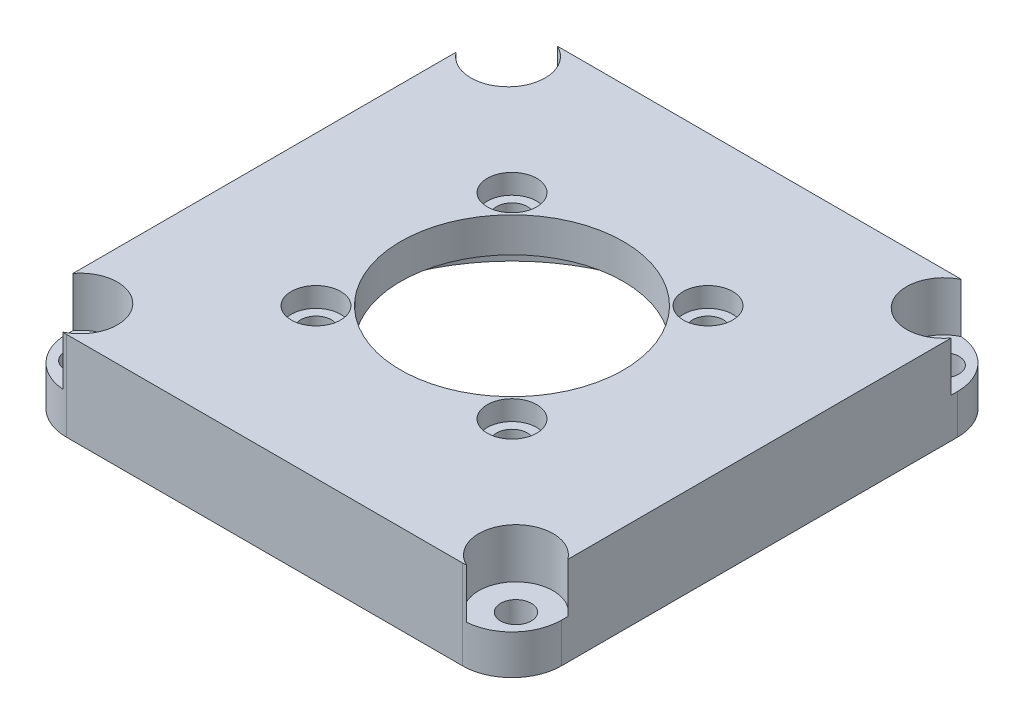
ISO-10303-21;
HEADER;
FILE_DESCRIPTION(('STEP AP214'),'2;1');
FILE_NAME('part.step','',(''),(''),'','','');
FILE_SCHEMA(('AUTOMOTIVE_DESIGN { 1 0 10303 214 1 1 1 1 }'));
ENDSEC;
DATA;
#1=APPLICATION_CONTEXT('core data for automotive mechanical design processes');
#2=APPLICATION_PROTOCOL_DEFINITION('international standard','automotive_design',2000,#1);
#3=PRODUCT_CONTEXT('',#1,'mechanical');
#4=PRODUCT('Part','Part','',(#3));
#5=PRODUCT_RELATED_PRODUCT_CATEGORY('part','',(#4));
#6=PRODUCT_DEFINITION_FORMATION('','',#4);
#7=PRODUCT_DEFINITION_CONTEXT('part definition',#1,'design');
#8=PRODUCT_DEFINITION('design','',#6,#7);
#9=PRODUCT_DEFINITION_SHAPE('','',#8);
#10=(LENGTH_UNIT() NAMED_UNIT(*) SI_UNIT(.MILLI.,.METRE.));
#11=(NAMED_UNIT(*) PLANE_ANGLE_UNIT() SI_UNIT($,.RADIAN.));
#12=(NAMED_UNIT(*) SI_UNIT($,.STERADIAN.) SOLID_ANGLE_UNIT());
#13=UNCERTAINTY_MEASURE_WITH_UNIT(LENGTH_MEASURE(1.E-05),#10,'distance_accuracy_value','');
#14=(GEOMETRIC_REPRESENTATION_CONTEXT(3) GLOBAL_UNCERTAINTY_ASSIGNED_CONTEXT((#13)) GLOBAL_UNIT_ASSIGNED_CONTEXT((#10,
#11,#12)) REPRESENTATION_CONTEXT('',''));
#15=CARTESIAN_POINT('',(0.,0.,0.));
#16=DIRECTION('',(0.,0.,1.));
#17=DIRECTION('',(1.,0.,0.));
#18=AXIS2_PLACEMENT_3D('',#15,#16,#17);
#19=CARTESIAN_POINT('',(-25.,12.,25.));
#20=DIRECTION('',(1.,0.,0.));
#21=DIRECTION('',(0.,0.,-1.));
#22=AXIS2_PLACEMENT_3D('',#19,#20,#21);
#23=PLANE('',#22);
#24=DIRECTION('',(0.,1.,0.));
#25=VECTOR('',#24,1.);
#26=CARTESIAN_POINT('',(-25.,4.,19.35));
#27=LINE('',#26,#25);
#28=CARTESIAN_POINT('',(-25.,9.,19.35));
#29=VERTEX_POINT('',#28);
#30=CARTESIAN_POINT('',(-25.,4.,19.35));
#31=VERTEX_POINT('',#30);
#32=EDGE_CURVE('E156',#29,#31,#27,.F.);
#33=ORIENTED_EDGE('',*,*,#32,.F.);
#34=DIRECTION('',(0.,0.,-1.));
#35=VECTOR('',#34,1.);
#36=CARTESIAN_POINT('',(-25.,9.,25.));
#37=LINE('',#36,#35);
#38=CARTESIAN_POINT('',(-25.,9.,-19.35));
#39=VERTEX_POINT('',#38);
#40=EDGE_CURVE('E166',#29,#39,#37,.T.);
#41=ORIENTED_EDGE('',*,*,#40,.T.);
#42=DIRECTION('',(0.,1.,0.));
#43=VECTOR('',#42,1.);
#44=CARTESIAN_POINT('',(-25.,4.,-19.35));
#45=LINE('',#44,#43);
#46=CARTESIAN_POINT('',(-25.,4.,-19.35));
#47=VERTEX_POINT('',#46);
#48=EDGE_CURVE('E308',#39,#47,#45,.F.);
#49=ORIENTED_EDGE('',*,*,#48,.T.);
#50=DIRECTION('',(0.,0.,1.));
#51=VECTOR('',#50,1.);
#52=CARTESIAN_POINT('',(-25.,4.,25.));
#53=LINE('',#52,#51);
#54=CARTESIAN_POINT('',(-25.,4.,-20.));
#55=VERTEX_POINT('',#54);
#56=EDGE_CURVE('E304',#55,#47,#53,.T.);
#57=ORIENTED_EDGE('',*,*,#56,.F.);
#58=DIRECTION('',(0.,-1.,0.));
#59=VECTOR('',#58,1.);
#60=CARTESIAN_POINT('',(-25.,12.,-20.));
#61=LINE('',#60,#59);
#62=CARTESIAN_POINT('',(-25.,0.,-20.));
#63=VERTEX_POINT('',#62);
#64=EDGE_CURVE('E209',#55,#63,#61,.T.);
#65=ORIENTED_EDGE('',*,*,#64,.T.);
#66=DIRECTION('',(0.,0.,1.));
#67=VECTOR('',#66,1.);
#68=CARTESIAN_POINT('',(-25.,0.,25.));
#69=LINE('',#68,#67);
#70=CARTESIAN_POINT('',(-25.,0.,20.));
#71=VERTEX_POINT('',#70);
#72=EDGE_CURVE('E201',#63,#71,#69,.T.);
#73=ORIENTED_EDGE('',*,*,#72,.T.);
#74=DIRECTION('',(0.,-1.,0.));
#75=VECTOR('',#74,1.);
#76=CARTESIAN_POINT('',(-25.,12.,20.));
#77=LINE('',#76,#75);
#78=CARTESIAN_POINT('',(-25.,4.,20.));
#79=VERTEX_POINT('',#78);
#80=EDGE_CURVE('E207',#71,#79,#77,.F.);
#81=ORIENTED_EDGE('',*,*,#80,.T.);
#82=DIRECTION('',(0.,0.,1.));
#83=VECTOR('',#82,1.);
#84=CARTESIAN_POINT('',(-25.,4.,25.));
#85=LINE('',#84,#83);
#86=EDGE_CURVE('E169',#31,#79,#85,.T.);
#87=ORIENTED_EDGE('',*,*,#86,.F.);
#88=EDGE_LOOP('',(#33,#41,#49,#57,#65,#73,#81,#87));
#89=FACE_BOUND('',#88,.T.);
#90=ADVANCED_FACE('F40',(#89),#23,.F.);
#91=CARTESIAN_POINT('',(-20.,12.,20.));
#92=DIRECTION('',(0.,-1.,0.));
#93=DIRECTION('',(0.,0.,-1.));
#94=AXIS2_PLACEMENT_3D('',#91,#92,#93);
#95=CYLINDRICAL_SURFACE('',#94,5.);
#96=CARTESIAN_POINT('',(-20.,9.,20.));
#97=DIRECTION('',(0.,-1.,0.));
#98=DIRECTION('',(0.,0.,-1.));
#99=AXIS2_PLACEMENT_3D('',#96,#97,#98);
#100=CIRCLE('',#99,5.);
#101=CARTESIAN_POINT('',(-20.3863331381223,9.,24.9850523273471));
#102=VERTEX_POINT('',#101);
#103=CARTESIAN_POINT('',(-20.,9.,25.));
#104=VERTEX_POINT('',#103);
#105=EDGE_CURVE('E177',#102,#104,#100,.F.);
#106=ORIENTED_EDGE('',*,*,#105,.F.);
#107=DIRECTION('',(0.,1.,0.));
#108=VECTOR('',#107,1.);
#109=CARTESIAN_POINT('',(-20.3863331381223,6.5,24.9850523273471));
#110=LINE('',#109,#108);
#111=CARTESIAN_POINT('',(-20.3863331381223,4.,24.9850523273471));
#112=VERTEX_POINT('',#111);
#113=EDGE_CURVE('E57',#102,#112,#110,.F.);
#114=ORIENTED_EDGE('',*,*,#113,.T.);
#115=CARTESIAN_POINT('',(-20.,4.,20.));
#116=DIRECTION('',(0.,1.,0.));
#117=DIRECTION('',(0.,0.,1.));
#118=AXIS2_PLACEMENT_3D('',#115,#116,#117);
#119=CIRCLE('',#118,5.);
#120=EDGE_CURVE('E705',#112,#79,#119,.F.);
#121=ORIENTED_EDGE('',*,*,#120,.T.);
#122=ORIENTED_EDGE('',*,*,#80,.F.);
#123=CARTESIAN_POINT('',(-20.,0.,20.));
#124=DIRECTION('',(0.,-1.,0.));
#125=DIRECTION('',(0.,0.,-1.));
#126=AXIS2_PLACEMENT_3D('',#123,#124,#125);
#127=CIRCLE('',#126,5.);
#128=CARTESIAN_POINT('',(-20.,0.,25.));
#129=VERTEX_POINT('',#128);
#130=EDGE_CURVE('E215',#129,#71,#127,.T.);
#131=ORIENTED_EDGE('',*,*,#130,.F.);
#132=DIRECTION('',(0.,-1.,0.));
#133=VECTOR('',#132,1.);
#134=CARTESIAN_POINT('',(-20.,12.,25.));
#135=LINE('',#134,#133);
#136=EDGE_CURVE('E227',#104,#129,#135,.T.);
#137=ORIENTED_EDGE('',*,*,#136,.F.);
#138=EDGE_LOOP('',(#106,#114,#121,#122,#131,#137));
#139=FACE_BOUND('',#138,.T.);
#140=ADVANCED_FACE('F393',(#139),#95,.T.);
#141=CARTESIAN_POINT('',(-22.,-3.,21.6));
#142=DIRECTION('',(0.,1.,0.));
#143=DIRECTION('',(0.,0.,1.));
#144=AXIS2_PLACEMENT_3D('',#141,#142,#143);
#145=CYLINDRICAL_SURFACE('',#144,1.55);
#146=CARTESIAN_POINT('',(-22.,0.,21.6));
#147=DIRECTION('',(0.,-1.,0.));
#148=DIRECTION('',(0.,0.,-1.));
#149=AXIS2_PLACEMENT_3D('',#146,#147,#148);
#150=CIRCLE('',#149,1.55);
#151=CARTESIAN_POINT('',(-22.,0.,20.05));
#152=VERTEX_POINT('',#151);
#153=EDGE_CURVE('E170',#152,#152,#150,.F.);
#154=ORIENTED_EDGE('',*,*,#153,.F.);
#155=EDGE_LOOP('',(#154));
#156=FACE_BOUND('',#155,.T.);
#157=CARTESIAN_POINT('',(-22.,4.,21.6));
#158=DIRECTION('',(0.,1.,0.));
#159=DIRECTION('',(0.,0.,1.));
#160=AXIS2_PLACEMENT_3D('',#157,#158,#159);
#161=CIRCLE('',#160,1.55);
#162=CARTESIAN_POINT('',(-22.,4.,23.15));
#163=VERTEX_POINT('',#162);
#164=EDGE_CURVE('E44',#163,#163,#161,.T.);
#165=ORIENTED_EDGE('',*,*,#164,.T.);
#166=EDGE_LOOP('',(#165));
#167=FACE_BOUND('',#166,.T.);
#168=ADVANCED_FACE('F398',(#156,#167),#145,.F.);
#169=CARTESIAN_POINT('',(22.,-3.,21.6));
#170=DIRECTION('',(0.,1.,0.));
#171=DIRECTION('',(0.,0.,1.));
#172=AXIS2_PLACEMENT_3D('',#169,#170,#171);
#173=CYLINDRICAL_SURFACE('',#172,1.55);
#174=CARTESIAN_POINT('',(22.,0.,21.6));
#175=DIRECTION('',(0.,-1.,0.));
#176=DIRECTION('',(0.,0.,-1.));
#177=AXIS2_PLACEMENT_3D('',#174,#175,#176);
#178=CIRCLE('',#177,1.55);
#179=CARTESIAN_POINT('',(22.,0.,20.05));
#180=VERTEX_POINT('',#179);
#181=EDGE_CURVE('E279',#180,#180,#178,.T.);
#182=ORIENTED_EDGE('',*,*,#181,.T.);
#183=EDGE_LOOP('',(#182));
#184=FACE_BOUND('',#183,.T.);
#185=CARTESIAN_POINT('',(22.,4.,21.6));
#186=DIRECTION('',(0.,1.,0.));
#187=DIRECTION('',(0.,0.,1.));
#188=AXIS2_PLACEMENT_3D('',#185,#186,#187);
#189=CIRCLE('',#188,1.55);
#190=CARTESIAN_POINT('',(22.,4.,23.15));
#191=VERTEX_POINT('',#190);
#192=EDGE_CURVE('E259',#191,#191,#189,.F.);
#193=ORIENTED_EDGE('',*,*,#192,.F.);
#194=EDGE_LOOP('',(#193));
#195=FACE_BOUND('',#194,.T.);
#196=ADVANCED_FACE('F411',(#184,#195),#173,.F.);
#197=CARTESIAN_POINT('',(25.,12.,25.));
#198=DIRECTION('',(-1.,0.,0.));
#199=DIRECTION('',(0.,0.,1.));
#200=AXIS2_PLACEMENT_3D('',#197,#198,#199);
#201=PLANE('',#200);
#202=DIRECTION('',(0.,0.,1.));
#203=VECTOR('',#202,1.);
#204=CARTESIAN_POINT('',(25.,9.,25.));
#205=LINE('',#204,#203);
#206=CARTESIAN_POINT('',(25.,9.,-19.35));
#207=VERTEX_POINT('',#206);
#208=CARTESIAN_POINT('',(25.,9.,19.35));
#209=VERTEX_POINT('',#208);
#210=EDGE_CURVE('E350',#207,#209,#205,.T.);
#211=ORIENTED_EDGE('',*,*,#210,.T.);
#212=DIRECTION('',(0.,1.,0.));
#213=VECTOR('',#212,1.);
#214=CARTESIAN_POINT('',(25.,4.,19.35));
#215=LINE('',#214,#213);
#216=CARTESIAN_POINT('',(25.,4.,19.35));
#217=VERTEX_POINT('',#216);
#218=EDGE_CURVE('E65',#209,#217,#215,.F.);
#219=ORIENTED_EDGE('',*,*,#218,.T.);
#220=DIRECTION('',(0.,0.,-1.));
#221=VECTOR('',#220,1.);
#222=CARTESIAN_POINT('',(25.,4.,25.));
#223=LINE('',#222,#221);
#224=CARTESIAN_POINT('',(25.,4.,20.));
#225=VERTEX_POINT('',#224);
#226=EDGE_CURVE('E266',#225,#217,#223,.T.);
#227=ORIENTED_EDGE('',*,*,#226,.F.);
#228=DIRECTION('',(0.,-1.,0.));
#229=VECTOR('',#228,1.);
#230=CARTESIAN_POINT('',(25.,12.,20.));
#231=LINE('',#230,#229);
#232=CARTESIAN_POINT('',(25.,0.,20.));
#233=VERTEX_POINT('',#232);
#234=EDGE_CURVE('E11',#225,#233,#231,.T.);
#235=ORIENTED_EDGE('',*,*,#234,.T.);
#236=DIRECTION('',(0.,0.,-1.));
#237=VECTOR('',#236,1.);
#238=CARTESIAN_POINT('',(25.,0.,25.));
#239=LINE('',#238,#237);
#240=CARTESIAN_POINT('',(25.,0.,-20.));
#241=VERTEX_POINT('',#240);
#242=EDGE_CURVE('E193',#233,#241,#239,.T.);
#243=ORIENTED_EDGE('',*,*,#242,.T.);
#244=DIRECTION('',(0.,-1.,0.));
#245=VECTOR('',#244,1.);
#246=CARTESIAN_POINT('',(25.,12.,-20.));
#247=LINE('',#246,#245);
#248=CARTESIAN_POINT('',(25.,4.,-20.));
#249=VERTEX_POINT('',#248);
#250=EDGE_CURVE('E49',#241,#249,#247,.F.);
#251=ORIENTED_EDGE('',*,*,#250,.T.);
#252=DIRECTION('',(0.,0.,-1.));
#253=VECTOR('',#252,1.);
#254=CARTESIAN_POINT('',(25.,4.,25.));
#255=LINE('',#254,#253);
#256=CARTESIAN_POINT('',(25.,4.,-19.35));
#257=VERTEX_POINT('',#256);
#258=EDGE_CURVE('E289',#257,#249,#255,.T.);
#259=ORIENTED_EDGE('',*,*,#258,.F.);
#260=DIRECTION('',(0.,1.,0.));
#261=VECTOR('',#260,1.);
#262=CARTESIAN_POINT('',(25.,4.,-19.35));
#263=LINE('',#262,#261);
#264=EDGE_CURVE('E294',#207,#257,#263,.F.);
#265=ORIENTED_EDGE('',*,*,#264,.F.);
#266=EDGE_LOOP('',(#211,#219,#227,#235,#243,#251,#259,#265));
#267=FACE_BOUND('',#266,.T.);
#268=ADVANCED_FACE('F408',(#267),#201,.F.);
#269=CARTESIAN_POINT('',(20.,12.,-20.));
#270=DIRECTION('',(0.,-1.,0.));
#271=DIRECTION('',(0.,0.,-1.));
#272=AXIS2_PLACEMENT_3D('',#269,#270,#271);
#273=CYLINDRICAL_SURFACE('',#272,5.);
#274=CARTESIAN_POINT('',(20.,9.,-20.));
#275=DIRECTION('',(0.,-1.,0.));
#276=DIRECTION('',(0.,0.,-1.));
#277=AXIS2_PLACEMENT_3D('',#274,#275,#276);
#278=CIRCLE('',#277,5.);
#279=CARTESIAN_POINT('',(20.3863331381223,9.,-24.9850523273471));
#280=VERTEX_POINT('',#279);
#281=CARTESIAN_POINT('',(20.,9.,-25.));
#282=VERTEX_POINT('',#281);
#283=EDGE_CURVE('E234',#280,#282,#278,.F.);
#284=ORIENTED_EDGE('',*,*,#283,.F.);
#285=DIRECTION('',(0.,1.,0.));
#286=VECTOR('',#285,1.);
#287=CARTESIAN_POINT('',(20.3863331381223,6.5,-24.9850523273471));
#288=LINE('',#287,#286);
#289=CARTESIAN_POINT('',(20.3863331381223,4.,-24.9850523273471));
#290=VERTEX_POINT('',#289);
#291=EDGE_CURVE('E291',#280,#290,#288,.F.);
#292=ORIENTED_EDGE('',*,*,#291,.T.);
#293=CARTESIAN_POINT('',(20.,4.,-20.));
#294=DIRECTION('',(0.,1.,0.));
#295=DIRECTION('',(0.,0.,1.));
#296=AXIS2_PLACEMENT_3D('',#293,#294,#295);
#297=CIRCLE('',#296,5.);
#298=EDGE_CURVE('E257',#290,#249,#297,.F.);
#299=ORIENTED_EDGE('',*,*,#298,.T.);
#300=ORIENTED_EDGE('',*,*,#250,.F.);
#301=CARTESIAN_POINT('',(20.,0.,-20.));
#302=DIRECTION('',(0.,-1.,0.));
#303=DIRECTION('',(0.,0.,-1.));
#304=AXIS2_PLACEMENT_3D('',#301,#302,#303);
#305=CIRCLE('',#304,5.);
#306=CARTESIAN_POINT('',(20.,0.,-25.));
#307=VERTEX_POINT('',#306);
#308=EDGE_CURVE('E211',#307,#241,#305,.T.);
#309=ORIENTED_EDGE('',*,*,#308,.F.);
#310=DIRECTION('',(0.,-1.,0.));
#311=VECTOR('',#310,1.);
#312=CARTESIAN_POINT('',(20.,12.,-25.));
#313=LINE('',#312,#311);
#314=EDGE_CURVE('E219',#282,#307,#313,.T.);
#315=ORIENTED_EDGE('',*,*,#314,.F.);
#316=EDGE_LOOP('',(#284,#292,#299,#300,#309,#315));
#317=FACE_BOUND('',#316,.T.);
#318=ADVANCED_FACE('F42',(#317),#273,.T.);
#319=CARTESIAN_POINT('',(22.,-3.,-21.6));
#320=DIRECTION('',(0.,1.,0.));
#321=DIRECTION('',(0.,0.,1.));
#322=AXIS2_PLACEMENT_3D('',#319,#320,#321);
#323=CYLINDRICAL_SURFACE('',#322,1.55);
#324=CARTESIAN_POINT('',(22.,0.,-21.6));
#325=DIRECTION('',(0.,-1.,0.));
#326=DIRECTION('',(0.,0.,-1.));
#327=AXIS2_PLACEMENT_3D('',#324,#325,#326);
#328=CIRCLE('',#327,1.55);
#329=CARTESIAN_POINT('',(22.,0.,-23.15));
#330=VERTEX_POINT('',#329);
#331=EDGE_CURVE('E296',#330,#330,#328,.F.);
#332=ORIENTED_EDGE('',*,*,#331,.F.);
#333=EDGE_LOOP('',(#332));
#334=FACE_BOUND('',#333,.T.);
#335=CARTESIAN_POINT('',(22.,4.,-21.6));
#336=DIRECTION('',(0.,1.,0.));
#337=DIRECTION('',(0.,0.,1.));
#338=AXIS2_PLACEMENT_3D('',#335,#336,#337);
#339=CIRCLE('',#338,1.55);
#340=CARTESIAN_POINT('',(22.,4.,-20.05));
#341=VERTEX_POINT('',#340);
#342=EDGE_CURVE('E255',#341,#341,#339,.T.);
#343=ORIENTED_EDGE('',*,*,#342,.T.);
#344=EDGE_LOOP('',(#343));
#345=FACE_BOUND('',#344,.T.);
#346=ADVANCED_FACE('F463',(#334,#345),#323,.F.);
#347=CARTESIAN_POINT('',(-22.,-3.,-21.6));
#348=DIRECTION('',(0.,1.,0.));
#349=DIRECTION('',(0.,0.,1.));
#350=AXIS2_PLACEMENT_3D('',#347,#348,#349);
#351=CYLINDRICAL_SURFACE('',#350,1.55);
#352=CARTESIAN_POINT('',(-22.,0.,-21.6));
#353=DIRECTION('',(0.,-1.,0.));
#354=DIRECTION('',(0.,0.,-1.));
#355=AXIS2_PLACEMENT_3D('',#352,#353,#354);
#356=CIRCLE('',#355,1.55);
#357=CARTESIAN_POINT('',(-22.,0.,-23.15));
#358=VERTEX_POINT('',#357);
#359=EDGE_CURVE('E310',#358,#358,#356,.T.);
#360=ORIENTED_EDGE('',*,*,#359,.T.);
#361=EDGE_LOOP('',(#360));
#362=FACE_BOUND('',#361,.T.);
#363=CARTESIAN_POINT('',(-22.,4.,-21.6));
#364=DIRECTION('',(0.,1.,0.));
#365=DIRECTION('',(0.,0.,1.));
#366=AXIS2_PLACEMENT_3D('',#363,#364,#365);
#367=CIRCLE('',#366,1.55);
#368=CARTESIAN_POINT('',(-22.,4.,-20.05));
#369=VERTEX_POINT('',#368);
#370=EDGE_CURVE('E250',#369,#369,#367,.F.);
#371=ORIENTED_EDGE('',*,*,#370,.F.);
#372=EDGE_LOOP('',(#371));
#373=FACE_BOUND('',#372,.T.);
#374=ADVANCED_FACE('F407',(#362,#373),#351,.F.);
#375=CARTESIAN_POINT('',(-25.,12.,-25.));
#376=DIRECTION('',(0.,0.,1.));
#377=DIRECTION('',(1.,0.,0.));
#378=AXIS2_PLACEMENT_3D('',#375,#376,#377);
#379=PLANE('',#378);
#380=DIRECTION('',(0.,-1.,0.));
#381=VECTOR('',#380,1.);
#382=CARTESIAN_POINT('',(-20.,12.,-25.));
#383=LINE('',#382,#381);
#384=CARTESIAN_POINT('',(-20.,0.,-25.));
#385=VERTEX_POINT('',#384);
#386=CARTESIAN_POINT('',(-20.,9.,-25.));
#387=VERTEX_POINT('',#386);
#388=EDGE_CURVE('E221',#385,#387,#383,.F.);
#389=ORIENTED_EDGE('',*,*,#388,.T.);
#390=DIRECTION('',(1.,0.,0.));
#391=VECTOR('',#390,1.);
#392=CARTESIAN_POINT('',(-25.,9.,-25.));
#393=LINE('',#392,#391);
#394=EDGE_CURVE('E347',#387,#282,#393,.T.);
#395=ORIENTED_EDGE('',*,*,#394,.T.);
#396=ORIENTED_EDGE('',*,*,#314,.T.);
#397=DIRECTION('',(-1.,0.,0.));
#398=VECTOR('',#397,1.);
#399=CARTESIAN_POINT('',(-25.,0.,-25.));
#400=LINE('',#399,#398);
#401=EDGE_CURVE('E198',#307,#385,#400,.T.);
#402=ORIENTED_EDGE('',*,*,#401,.T.);
#403=EDGE_LOOP('',(#389,#395,#396,#402));
#404=FACE_BOUND('',#403,.T.);
#405=ADVANCED_FACE('F362',(#404),#379,.F.);
#406=CARTESIAN_POINT('',(-25.,12.,25.));
#407=DIRECTION('',(0.,0.,-1.));
#408=DIRECTION('',(-1.,0.,0.));
#409=AXIS2_PLACEMENT_3D('',#406,#407,#408);
#410=PLANE('',#409);
#411=DIRECTION('',(0.,-1.,0.));
#412=VECTOR('',#411,1.);
#413=CARTESIAN_POINT('',(20.,12.,25.));
#414=LINE('',#413,#412);
#415=CARTESIAN_POINT('',(20.,0.,25.));
#416=VERTEX_POINT('',#415);
#417=CARTESIAN_POINT('',(20.,9.,25.));
#418=VERTEX_POINT('',#417);
#419=EDGE_CURVE('E224',#416,#418,#414,.F.);
#420=ORIENTED_EDGE('',*,*,#419,.T.);
#421=DIRECTION('',(-1.,0.,0.));
#422=VECTOR('',#421,1.);
#423=CARTESIAN_POINT('',(-25.,9.,25.));
#424=LINE('',#423,#422);
#425=EDGE_CURVE('E178',#418,#104,#424,.T.);
#426=ORIENTED_EDGE('',*,*,#425,.T.);
#427=ORIENTED_EDGE('',*,*,#136,.T.);
#428=DIRECTION('',(1.,0.,0.));
#429=VECTOR('',#428,1.);
#430=CARTESIAN_POINT('',(-25.,0.,25.));
#431=LINE('',#430,#429);
#432=EDGE_CURVE('E204',#129,#416,#431,.T.);
#433=ORIENTED_EDGE('',*,*,#432,.T.);
#434=EDGE_LOOP('',(#420,#426,#427,#433));
#435=FACE_BOUND('',#434,.T.);
#436=ADVANCED_FACE('F403',(#435),#410,.F.);
#437=CARTESIAN_POINT('',(0.,0.,0.));
#438=DIRECTION('',(0.,-1.,0.));
#439=DIRECTION('',(0.,0.,-1.));
#440=AXIS2_PLACEMENT_3D('',#437,#438,#439);
#441=PLANE('',#440);
#442=ORIENTED_EDGE('',*,*,#153,.T.);
#443=EDGE_LOOP('',(#442));
#444=FACE_BOUND('',#443,.T.);
#445=ORIENTED_EDGE('',*,*,#181,.F.);
#446=EDGE_LOOP('',(#445));
#447=FACE_BOUND('',#446,.T.);
#448=ORIENTED_EDGE('',*,*,#331,.T.);
#449=EDGE_LOOP('',(#448));
#450=FACE_BOUND('',#449,.T.);
#451=ORIENTED_EDGE('',*,*,#359,.F.);
#452=EDGE_LOOP('',(#451));
#453=FACE_BOUND('',#452,.T.);
#454=CARTESIAN_POINT('',(0.,0.,0.));
#455=DIRECTION('',(0.,-1.,0.));
#456=DIRECTION('',(0.,0.,-1.));
#457=AXIS2_PLACEMENT_3D('',#454,#455,#456);
#458=CIRCLE('',#457,18.25);
#459=CARTESIAN_POINT('',(0.,0.,-18.25));
#460=VERTEX_POINT('',#459);
#461=EDGE_CURVE('E189',#460,#460,#458,.T.);
#462=ORIENTED_EDGE('',*,*,#461,.F.);
#463=EDGE_LOOP('',(#462));
#464=FACE_BOUND('',#463,.T.);
#465=ORIENTED_EDGE('',*,*,#72,.F.);
#466=CARTESIAN_POINT('',(-20.,0.,-20.));
#467=DIRECTION('',(0.,-1.,0.));
#468=DIRECTION('',(0.,0.,-1.));
#469=AXIS2_PLACEMENT_3D('',#466,#467,#468);
#470=CIRCLE('',#469,5.);
#471=EDGE_CURVE('E217',#63,#385,#470,.T.);
#472=ORIENTED_EDGE('',*,*,#471,.T.);
#473=ORIENTED_EDGE('',*,*,#401,.F.);
#474=ORIENTED_EDGE('',*,*,#308,.T.);
#475=ORIENTED_EDGE('',*,*,#242,.F.);
#476=CARTESIAN_POINT('',(20.,0.,20.));
#477=DIRECTION('',(0.,-1.,0.));
#478=DIRECTION('',(0.,0.,-1.));
#479=AXIS2_PLACEMENT_3D('',#476,#477,#478);
#480=CIRCLE('',#479,5.);
#481=EDGE_CURVE('E213',#233,#416,#480,.T.);
#482=ORIENTED_EDGE('',*,*,#481,.T.);
#483=ORIENTED_EDGE('',*,*,#432,.F.);
#484=ORIENTED_EDGE('',*,*,#130,.T.);
#485=EDGE_LOOP('',(#465,#472,#473,#474,#475,#482,#483,#484));
#486=FACE_BOUND('',#485,.T.);
#487=ADVANCED_FACE('F368',(#444,#447,#450,#453,#464,#486),#441,.T.);
#488=CARTESIAN_POINT('',(-20.,12.,-20.));
#489=DIRECTION('',(0.,-1.,0.));
#490=DIRECTION('',(0.,0.,-1.));
#491=AXIS2_PLACEMENT_3D('',#488,#489,#490);
#492=CYLINDRICAL_SURFACE('',#491,5.);
#493=DIRECTION('',(0.,1.,0.));
#494=VECTOR('',#493,1.);
#495=CARTESIAN_POINT('',(-20.3863331381223,6.5,-24.9850523273471));
#496=LINE('',#495,#494);
#497=CARTESIAN_POINT('',(-20.3863331381223,9.,-24.9850523273471));
#498=VERTEX_POINT('',#497);
#499=CARTESIAN_POINT('',(-20.3863331381223,4.,-24.9850523273471));
#500=VERTEX_POINT('',#499);
#501=EDGE_CURVE('E306',#498,#500,#496,.F.);
#502=ORIENTED_EDGE('',*,*,#501,.F.);
#503=CARTESIAN_POINT('',(-20.,9.,-20.));
#504=DIRECTION('',(0.,-1.,0.));
#505=DIRECTION('',(0.,0.,-1.));
#506=AXIS2_PLACEMENT_3D('',#503,#504,#505);
#507=CIRCLE('',#506,5.);
#508=EDGE_CURVE('E183',#387,#498,#507,.F.);
#509=ORIENTED_EDGE('',*,*,#508,.F.);
#510=ORIENTED_EDGE('',*,*,#388,.F.);
#511=ORIENTED_EDGE('',*,*,#471,.F.);
#512=ORIENTED_EDGE('',*,*,#64,.F.);
#513=CARTESIAN_POINT('',(-20.,4.,-20.));
#514=DIRECTION('',(0.,1.,0.));
#515=DIRECTION('',(0.,0.,1.));
#516=AXIS2_PLACEMENT_3D('',#513,#514,#515);
#517=CIRCLE('',#516,5.);
#518=EDGE_CURVE('E253',#55,#500,#517,.F.);
#519=ORIENTED_EDGE('',*,*,#518,.T.);
#520=EDGE_LOOP('',(#502,#509,#510,#511,#512,#519));
#521=FACE_BOUND('',#520,.T.);
#522=ADVANCED_FACE('F359',(#521),#492,.T.);
#523=CARTESIAN_POINT('',(20.,12.,20.));
#524=DIRECTION('',(0.,-1.,0.));
#525=DIRECTION('',(0.,0.,-1.));
#526=AXIS2_PLACEMENT_3D('',#523,#524,#525);
#527=CYLINDRICAL_SURFACE('',#526,5.);
#528=DIRECTION('',(0.,1.,0.));
#529=VECTOR('',#528,1.);
#530=CARTESIAN_POINT('',(20.3863331381223,6.5,24.9850523273471));
#531=LINE('',#530,#529);
#532=CARTESIAN_POINT('',(20.3863331381223,9.,24.9850523273471));
#533=VERTEX_POINT('',#532);
#534=CARTESIAN_POINT('',(20.3863331381223,4.,24.9850523273471));
#535=VERTEX_POINT('',#534);
#536=EDGE_CURVE('E276',#533,#535,#531,.F.);
#537=ORIENTED_EDGE('',*,*,#536,.F.);
#538=CARTESIAN_POINT('',(20.,9.,20.));
#539=DIRECTION('',(0.,-1.,0.));
#540=DIRECTION('',(0.,0.,-1.));
#541=AXIS2_PLACEMENT_3D('',#538,#539,#540);
#542=CIRCLE('',#541,5.);
#543=EDGE_CURVE('E353',#418,#533,#542,.F.);
#544=ORIENTED_EDGE('',*,*,#543,.F.);
#545=ORIENTED_EDGE('',*,*,#419,.F.);
#546=ORIENTED_EDGE('',*,*,#481,.F.);
#547=ORIENTED_EDGE('',*,*,#234,.F.);
#548=CARTESIAN_POINT('',(20.,4.,20.));
#549=DIRECTION('',(0.,1.,0.));
#550=DIRECTION('',(0.,0.,1.));
#551=AXIS2_PLACEMENT_3D('',#548,#549,#550);
#552=CIRCLE('',#551,5.);
#553=EDGE_CURVE('E261',#225,#535,#552,.F.);
#554=ORIENTED_EDGE('',*,*,#553,.T.);
#555=EDGE_LOOP('',(#537,#544,#545,#546,#547,#554));
#556=FACE_BOUND('',#555,.T.);
#557=ADVANCED_FACE('F414',(#556),#527,.T.);
#558=CARTESIAN_POINT('',(0.,5.5,0.));
#559=DIRECTION('',(0.,-1.,0.));
#560=DIRECTION('',(0.,0.,-1.));
#561=AXIS2_PLACEMENT_3D('',#558,#559,#560);
#562=CYLINDRICAL_SURFACE('',#561,18.25);
#563=CARTESIAN_POINT('',(0.,5.5,0.));
#564=DIRECTION('',(0.,-1.,0.));
#565=DIRECTION('',(0.,0.,-1.));
#566=AXIS2_PLACEMENT_3D('',#563,#564,#565);
#567=CIRCLE('',#566,18.25);
#568=CARTESIAN_POINT('',(0.,5.5,-18.25));
#569=VERTEX_POINT('',#568);
#570=EDGE_CURVE('E190',#569,#569,#567,.T.);
#571=ORIENTED_EDGE('',*,*,#570,.F.);
#572=EDGE_LOOP('',(#571));
#573=FACE_BOUND('',#572,.T.);
#574=ORIENTED_EDGE('',*,*,#461,.T.);
#575=EDGE_LOOP('',(#574));
#576=FACE_BOUND('',#575,.T.);
#577=ADVANCED_FACE('F416',(#573,#576),#562,.F.);
#578=CARTESIAN_POINT('',(0.,5.5,0.));
#579=DIRECTION('',(0.,-1.,0.));
#580=DIRECTION('',(0.,0.,-1.));
#581=AXIS2_PLACEMENT_3D('',#578,#579,#580);
#582=PLANE('',#581);
#583=CARTESIAN_POINT('',(9.89949493661167,5.5,-9.89949493661166));
#584=DIRECTION('',(0.,-1.,0.));
#585=DIRECTION('',(0.,0.,-1.));
#586=AXIS2_PLACEMENT_3D('',#583,#584,#585);
#587=CIRCLE('',#586,1.55);
#588=CARTESIAN_POINT('',(9.89949493661167,5.5,-11.4494949366117));
#589=VERTEX_POINT('',#588);
#590=EDGE_CURVE('E246',#589,#589,#587,.T.);
#591=ORIENTED_EDGE('',*,*,#590,.F.);
#592=EDGE_LOOP('',(#591));
#593=FACE_BOUND('',#592,.T.);
#594=CARTESIAN_POINT('',(-9.89949493661166,5.5,9.89949493661167));
#595=DIRECTION('',(0.,-1.,0.));
#596=DIRECTION('',(0.,0.,-1.));
#597=AXIS2_PLACEMENT_3D('',#594,#595,#596);
#598=CIRCLE('',#597,1.55);
#599=CARTESIAN_POINT('',(-9.89949493661166,5.5,8.34949493661167));
#600=VERTEX_POINT('',#599);
#601=EDGE_CURVE('E243',#600,#600,#598,.T.);
#602=ORIENTED_EDGE('',*,*,#601,.F.);
#603=EDGE_LOOP('',(#602));
#604=FACE_BOUND('',#603,.T.);
#605=CARTESIAN_POINT('',(9.89949493661167,5.5,9.89949493661167));
#606=DIRECTION('',(0.,-1.,0.));
#607=DIRECTION('',(0.,0.,-1.));
#608=AXIS2_PLACEMENT_3D('',#605,#606,#607);
#609=CIRCLE('',#608,1.55);
#610=CARTESIAN_POINT('',(9.89949493661167,5.5,8.34949493661167));
#611=VERTEX_POINT('',#610);
#612=EDGE_CURVE('E239',#611,#611,#609,.T.);
#613=ORIENTED_EDGE('',*,*,#612,.F.);
#614=EDGE_LOOP('',(#613));
#615=FACE_BOUND('',#614,.T.);
#616=CARTESIAN_POINT('',(-9.89949493661165,5.5,-9.89949493661168));
#617=DIRECTION('',(0.,-1.,0.));
#618=DIRECTION('',(0.,0.,-1.));
#619=AXIS2_PLACEMENT_3D('',#616,#617,#618);
#620=CIRCLE('',#619,1.55);
#621=CARTESIAN_POINT('',(-9.89949493661165,5.5,-11.4494949366117));
#622=VERTEX_POINT('',#621);
#623=EDGE_CURVE('E236',#622,#622,#620,.T.);
#624=ORIENTED_EDGE('',*,*,#623,.F.);
#625=EDGE_LOOP('',(#624));
#626=FACE_BOUND('',#625,.T.);
#627=CARTESIAN_POINT('',(0.,5.5,0.));
#628=DIRECTION('',(0.,-1.,0.));
#629=DIRECTION('',(0.,0.,-1.));
#630=AXIS2_PLACEMENT_3D('',#627,#628,#629);
#631=CIRCLE('',#630,11.25);
#632=CARTESIAN_POINT('',(0.,5.5,-11.25));
#633=VERTEX_POINT('',#632);
#634=EDGE_CURVE('E180',#633,#633,#631,.T.);
#635=ORIENTED_EDGE('',*,*,#634,.F.);
#636=EDGE_LOOP('',(#635));
#637=FACE_BOUND('',#636,.T.);
#638=ORIENTED_EDGE('',*,*,#570,.T.);
#639=EDGE_LOOP('',(#638));
#640=FACE_BOUND('',#639,.T.);
#641=ADVANCED_FACE('F421',(#593,#604,#615,#626,#637,#640),#582,.T.);
#642=CARTESIAN_POINT('',(0.,15.5,0.));
#643=DIRECTION('',(0.,-1.,0.));
#644=DIRECTION('',(0.,0.,-1.));
#645=AXIS2_PLACEMENT_3D('',#642,#643,#644);
#646=CYLINDRICAL_SURFACE('',#645,11.25);
#647=CARTESIAN_POINT('',(0.,9.,0.));
#648=DIRECTION('',(0.,-1.,0.));
#649=DIRECTION('',(0.,0.,-1.));
#650=AXIS2_PLACEMENT_3D('',#647,#648,#649);
#651=CIRCLE('',#650,11.25);
#652=CARTESIAN_POINT('',(0.,9.,-11.25));
#653=VERTEX_POINT('',#652);
#654=EDGE_CURVE('E231',#653,#653,#651,.F.);
#655=ORIENTED_EDGE('',*,*,#654,.T.);
#656=EDGE_LOOP('',(#655));
#657=FACE_BOUND('',#656,.T.);
#658=ORIENTED_EDGE('',*,*,#634,.T.);
#659=EDGE_LOOP('',(#658));
#660=FACE_BOUND('',#659,.T.);
#661=ADVANCED_FACE('F492',(#657,#660),#646,.F.);
#662=CARTESIAN_POINT('',(0.,9.,0.));
#663=DIRECTION('',(0.,-1.,0.));
#664=DIRECTION('',(0.,0.,-1.));
#665=AXIS2_PLACEMENT_3D('',#662,#663,#664);
#666=PLANE('',#665);
#667=CARTESIAN_POINT('',(-22.,9.,21.6));
#668=DIRECTION('',(0.,-1.,0.));
#669=DIRECTION('',(0.,0.,-1.));
#670=AXIS2_PLACEMENT_3D('',#667,#668,#669);
#671=CIRCLE('',#670,3.75);
#672=EDGE_CURVE('E153',#29,#102,#671,.T.);
#673=ORIENTED_EDGE('',*,*,#672,.T.);
#674=ORIENTED_EDGE('',*,*,#105,.T.);
#675=ORIENTED_EDGE('',*,*,#425,.F.);
#676=ORIENTED_EDGE('',*,*,#543,.T.);
#677=CARTESIAN_POINT('',(22.,9.,21.6));
#678=DIRECTION('',(0.,1.,0.));
#679=DIRECTION('',(0.,0.,-1.));
#680=AXIS2_PLACEMENT_3D('',#677,#678,#679);
#681=CIRCLE('',#680,3.75);
#682=EDGE_CURVE('E269',#209,#533,#681,.T.);
#683=ORIENTED_EDGE('',*,*,#682,.F.);
#684=ORIENTED_EDGE('',*,*,#210,.F.);
#685=CARTESIAN_POINT('',(22.,9.,-21.6));
#686=DIRECTION('',(0.,-1.,0.));
#687=DIRECTION('',(0.,0.,1.));
#688=AXIS2_PLACEMENT_3D('',#685,#686,#687);
#689=CIRCLE('',#688,3.75);
#690=EDGE_CURVE('E282',#207,#280,#689,.T.);
#691=ORIENTED_EDGE('',*,*,#690,.T.);
#692=ORIENTED_EDGE('',*,*,#283,.T.);
#693=ORIENTED_EDGE('',*,*,#394,.F.);
#694=ORIENTED_EDGE('',*,*,#508,.T.);
#695=CARTESIAN_POINT('',(-22.,9.,-21.6));
#696=DIRECTION('',(0.,1.,0.));
#697=DIRECTION('',(0.,0.,1.));
#698=AXIS2_PLACEMENT_3D('',#695,#696,#697);
#699=CIRCLE('',#698,3.75);
#700=EDGE_CURVE('E176',#39,#498,#699,.T.);
#701=ORIENTED_EDGE('',*,*,#700,.F.);
#702=ORIENTED_EDGE('',*,*,#40,.F.);
#703=EDGE_LOOP('',(#673,#674,#675,#676,#683,#684,#691,#692,#693,#694,#701,#702));
#704=FACE_BOUND('',#703,.T.);
#705=CARTESIAN_POINT('',(9.89949493661167,9.,-9.89949493661166));
#706=DIRECTION('',(0.,1.,0.));
#707=DIRECTION('',(0.,0.,1.));
#708=AXIS2_PLACEMENT_3D('',#705,#706,#707);
#709=CIRCLE('',#708,2.5);
#710=CARTESIAN_POINT('',(9.89949493661167,9.,-7.39949493661166));
#711=VERTEX_POINT('',#710);
#712=EDGE_CURVE('E334',#711,#711,#709,.T.);
#713=ORIENTED_EDGE('',*,*,#712,.F.);
#714=EDGE_LOOP('',(#713));
#715=FACE_BOUND('',#714,.T.);
#716=CARTESIAN_POINT('',(-9.89949493661166,9.,9.89949493661167));
#717=DIRECTION('',(0.,1.,0.));
#718=DIRECTION('',(0.,0.,1.));
#719=AXIS2_PLACEMENT_3D('',#716,#717,#718);
#720=CIRCLE('',#719,2.5);
#721=CARTESIAN_POINT('',(-9.89949493661166,9.,12.3994949366117));
#722=VERTEX_POINT('',#721);
#723=EDGE_CURVE('E327',#722,#722,#720,.T.);
#724=ORIENTED_EDGE('',*,*,#723,.F.);
#725=EDGE_LOOP('',(#724));
#726=FACE_BOUND('',#725,.T.);
#727=CARTESIAN_POINT('',(9.89949493661167,9.,9.89949493661167));
#728=DIRECTION('',(0.,1.,0.));
#729=DIRECTION('',(0.,0.,1.));
#730=AXIS2_PLACEMENT_3D('',#727,#728,#729);
#731=CIRCLE('',#730,2.5);
#732=CARTESIAN_POINT('',(9.89949493661167,9.,12.3994949366117));
#733=VERTEX_POINT('',#732);
#734=EDGE_CURVE('E249',#733,#733,#731,.T.);
#735=ORIENTED_EDGE('',*,*,#734,.F.);
#736=EDGE_LOOP('',(#735));
#737=FACE_BOUND('',#736,.T.);
#738=CARTESIAN_POINT('',(-9.89949493661165,9.,-9.89949493661168));
#739=DIRECTION('',(0.,1.,0.));
#740=DIRECTION('',(0.,0.,1.));
#741=AXIS2_PLACEMENT_3D('',#738,#739,#740);
#742=CIRCLE('',#741,2.5);
#743=CARTESIAN_POINT('',(-9.89949493661165,9.,-7.39949493661168));
#744=VERTEX_POINT('',#743);
#745=EDGE_CURVE('E333',#744,#744,#742,.T.);
#746=ORIENTED_EDGE('',*,*,#745,.F.);
#747=EDGE_LOOP('',(#746));
#748=FACE_BOUND('',#747,.T.);
#749=ORIENTED_EDGE('',*,*,#654,.F.);
#750=EDGE_LOOP('',(#749));
#751=FACE_BOUND('',#750,.T.);
#752=ADVANCED_FACE('F173',(#704,#715,#726,#737,#748,#751),#666,.F.);
#753=CARTESIAN_POINT('',(-9.89949493661165,7.,-9.89949493661168));
#754=DIRECTION('',(0.,1.,0.));
#755=DIRECTION('',(0.,0.,1.));
#756=AXIS2_PLACEMENT_3D('',#753,#754,#755);
#757=CYLINDRICAL_SURFACE('',#756,2.5);
#758=CARTESIAN_POINT('',(-9.89949493661165,7.,-9.89949493661168));
#759=DIRECTION('',(0.,1.,0.));
#760=DIRECTION('',(0.,0.,1.));
#761=AXIS2_PLACEMENT_3D('',#758,#759,#760);
#762=CIRCLE('',#761,2.5);
#763=CARTESIAN_POINT('',(-9.89949493661165,7.,-7.39949493661168));
#764=VERTEX_POINT('',#763);
#765=EDGE_CURVE('E235',#764,#764,#762,.T.);
#766=ORIENTED_EDGE('',*,*,#765,.F.);
#767=EDGE_LOOP('',(#766));
#768=FACE_BOUND('',#767,.T.);
#769=ORIENTED_EDGE('',*,*,#745,.T.);
#770=EDGE_LOOP('',(#769));
#771=FACE_BOUND('',#770,.T.);
#772=ADVANCED_FACE('F499',(#768,#771),#757,.F.);
#773=CARTESIAN_POINT('',(-9.89949493661165,7.,-9.89949493661168));
#774=DIRECTION('',(0.,1.,0.));
#775=DIRECTION('',(0.,0.,1.));
#776=AXIS2_PLACEMENT_3D('',#773,#774,#775);
#777=PLANE('',#776);
#778=CARTESIAN_POINT('',(-9.89949493661165,7.,-9.89949493661168));
#779=DIRECTION('',(0.,1.,0.));
#780=DIRECTION('',(0.,0.,1.));
#781=AXIS2_PLACEMENT_3D('',#778,#779,#780);
#782=CIRCLE('',#781,1.55);
#783=CARTESIAN_POINT('',(-9.89949493661165,7.,-8.34949493661168));
#784=VERTEX_POINT('',#783);
#785=EDGE_CURVE('E240',#784,#784,#782,.T.);
#786=ORIENTED_EDGE('',*,*,#785,.F.);
#787=EDGE_LOOP('',(#786));
#788=FACE_BOUND('',#787,.T.);
#789=ORIENTED_EDGE('',*,*,#765,.T.);
#790=EDGE_LOOP('',(#789));
#791=FACE_BOUND('',#790,.T.);
#792=ADVANCED_FACE('F502',(#788,#791),#777,.T.);
#793=CARTESIAN_POINT('',(9.89949493661167,7.,9.89949493661167));
#794=DIRECTION('',(0.,1.,0.));
#795=DIRECTION('',(0.,0.,1.));
#796=AXIS2_PLACEMENT_3D('',#793,#794,#795);
#797=CYLINDRICAL_SURFACE('',#796,2.5);
#798=CARTESIAN_POINT('',(9.89949493661167,7.,9.89949493661167));
#799=DIRECTION('',(0.,1.,0.));
#800=DIRECTION('',(0.,0.,1.));
#801=AXIS2_PLACEMENT_3D('',#798,#799,#800);
#802=CIRCLE('',#801,2.5);
#803=CARTESIAN_POINT('',(9.89949493661167,7.,12.3994949366117));
#804=VERTEX_POINT('',#803);
#805=EDGE_CURVE('E324',#804,#804,#802,.T.);
#806=ORIENTED_EDGE('',*,*,#805,.F.);
#807=EDGE_LOOP('',(#806));
#808=FACE_BOUND('',#807,.T.);
#809=ORIENTED_EDGE('',*,*,#734,.T.);
#810=EDGE_LOOP('',(#809));
#811=FACE_BOUND('',#810,.T.);
#812=ADVANCED_FACE('F506',(#808,#811),#797,.F.);
#813=CARTESIAN_POINT('',(9.89949493661167,7.,9.89949493661167));
#814=DIRECTION('',(0.,1.,0.));
#815=DIRECTION('',(0.,0.,1.));
#816=AXIS2_PLACEMENT_3D('',#813,#814,#815);
#817=PLANE('',#816);
#818=CARTESIAN_POINT('',(9.89949493661167,7.,9.89949493661167));
#819=DIRECTION('',(0.,1.,0.));
#820=DIRECTION('',(0.,0.,1.));
#821=AXIS2_PLACEMENT_3D('',#818,#819,#820);
#822=CIRCLE('',#821,1.55);
#823=CARTESIAN_POINT('',(9.89949493661167,7.,11.4494949366117));
#824=VERTEX_POINT('',#823);
#825=EDGE_CURVE('E313',#824,#824,#822,.T.);
#826=ORIENTED_EDGE('',*,*,#825,.F.);
#827=EDGE_LOOP('',(#826));
#828=FACE_BOUND('',#827,.T.);
#829=ORIENTED_EDGE('',*,*,#805,.T.);
#830=EDGE_LOOP('',(#829));
#831=FACE_BOUND('',#830,.T.);
#832=ADVANCED_FACE('F512',(#828,#831),#817,.T.);
#833=CARTESIAN_POINT('',(-9.89949493661166,7.,9.89949493661167));
#834=DIRECTION('',(0.,1.,0.));
#835=DIRECTION('',(0.,0.,1.));
#836=AXIS2_PLACEMENT_3D('',#833,#834,#835);
#837=CYLINDRICAL_SURFACE('',#836,2.5);
#838=CARTESIAN_POINT('',(-9.89949493661166,7.,9.89949493661167));
#839=DIRECTION('',(0.,1.,0.));
#840=DIRECTION('',(0.,0.,1.));
#841=AXIS2_PLACEMENT_3D('',#838,#839,#840);
#842=CIRCLE('',#841,2.5);
#843=CARTESIAN_POINT('',(-9.89949493661166,7.,12.3994949366117));
#844=VERTEX_POINT('',#843);
#845=EDGE_CURVE('E337',#844,#844,#842,.T.);
#846=ORIENTED_EDGE('',*,*,#845,.F.);
#847=EDGE_LOOP('',(#846));
#848=FACE_BOUND('',#847,.T.);
#849=ORIENTED_EDGE('',*,*,#723,.T.);
#850=EDGE_LOOP('',(#849));
#851=FACE_BOUND('',#850,.T.);
#852=ADVANCED_FACE('F508',(#848,#851),#837,.F.);
#853=CARTESIAN_POINT('',(-9.89949493661166,7.,9.89949493661167));
#854=DIRECTION('',(0.,1.,0.));
#855=DIRECTION('',(0.,0.,1.));
#856=AXIS2_PLACEMENT_3D('',#853,#854,#855);
#857=PLANE('',#856);
#858=CARTESIAN_POINT('',(-9.89949493661166,7.,9.89949493661167));
#859=DIRECTION('',(0.,1.,0.));
#860=DIRECTION('',(0.,0.,1.));
#861=AXIS2_PLACEMENT_3D('',#858,#859,#860);
#862=CIRCLE('',#861,1.55);
#863=CARTESIAN_POINT('',(-9.89949493661166,7.,11.4494949366117));
#864=VERTEX_POINT('',#863);
#865=EDGE_CURVE('E316',#864,#864,#862,.T.);
#866=ORIENTED_EDGE('',*,*,#865,.F.);
#867=EDGE_LOOP('',(#866));
#868=FACE_BOUND('',#867,.T.);
#869=ORIENTED_EDGE('',*,*,#845,.T.);
#870=EDGE_LOOP('',(#869));
#871=FACE_BOUND('',#870,.T.);
#872=ADVANCED_FACE('F511',(#868,#871),#857,.T.);
#873=CARTESIAN_POINT('',(9.89949493661167,7.,-9.89949493661166));
#874=DIRECTION('',(0.,1.,0.));
#875=DIRECTION('',(0.,0.,1.));
#876=AXIS2_PLACEMENT_3D('',#873,#874,#875);
#877=CYLINDRICAL_SURFACE('',#876,2.5);
#878=CARTESIAN_POINT('',(9.89949493661167,7.,-9.89949493661166));
#879=DIRECTION('',(0.,1.,0.));
#880=DIRECTION('',(0.,0.,1.));
#881=AXIS2_PLACEMENT_3D('',#878,#879,#880);
#882=CIRCLE('',#881,2.5);
#883=CARTESIAN_POINT('',(9.89949493661167,7.,-7.39949493661166));
#884=VERTEX_POINT('',#883);
#885=EDGE_CURVE('E330',#884,#884,#882,.T.);
#886=ORIENTED_EDGE('',*,*,#885,.F.);
#887=EDGE_LOOP('',(#886));
#888=FACE_BOUND('',#887,.T.);
#889=ORIENTED_EDGE('',*,*,#712,.T.);
#890=EDGE_LOOP('',(#889));
#891=FACE_BOUND('',#890,.T.);
#892=ADVANCED_FACE('F516',(#888,#891),#877,.F.);
#893=CARTESIAN_POINT('',(9.89949493661167,7.,-9.89949493661166));
#894=DIRECTION('',(0.,1.,0.));
#895=DIRECTION('',(0.,0.,1.));
#896=AXIS2_PLACEMENT_3D('',#893,#894,#895);
#897=PLANE('',#896);
#898=CARTESIAN_POINT('',(9.89949493661167,7.,-9.89949493661166));
#899=DIRECTION('',(0.,1.,0.));
#900=DIRECTION('',(0.,0.,1.));
#901=AXIS2_PLACEMENT_3D('',#898,#899,#900);
#902=CIRCLE('',#901,1.55);
#903=CARTESIAN_POINT('',(9.89949493661167,7.,-8.34949493661166));
#904=VERTEX_POINT('',#903);
#905=EDGE_CURVE('E317',#904,#904,#902,.T.);
#906=ORIENTED_EDGE('',*,*,#905,.F.);
#907=EDGE_LOOP('',(#906));
#908=FACE_BOUND('',#907,.T.);
#909=ORIENTED_EDGE('',*,*,#885,.T.);
#910=EDGE_LOOP('',(#909));
#911=FACE_BOUND('',#910,.T.);
#912=ADVANCED_FACE('F520',(#908,#911),#897,.T.);
#913=CARTESIAN_POINT('',(-9.89949493661165,4.,-9.89949493661168));
#914=DIRECTION('',(0.,1.,0.));
#915=DIRECTION('',(0.,0.,1.));
#916=AXIS2_PLACEMENT_3D('',#913,#914,#915);
#917=CYLINDRICAL_SURFACE('',#916,1.55);
#918=ORIENTED_EDGE('',*,*,#623,.T.);
#919=EDGE_LOOP('',(#918));
#920=FACE_BOUND('',#919,.T.);
#921=ORIENTED_EDGE('',*,*,#785,.T.);
#922=EDGE_LOOP('',(#921));
#923=FACE_BOUND('',#922,.T.);
#924=ADVANCED_FACE('F524',(#920,#923),#917,.F.);
#925=CARTESIAN_POINT('',(9.89949493661167,4.,9.89949493661167));
#926=DIRECTION('',(0.,1.,0.));
#927=DIRECTION('',(0.,0.,1.));
#928=AXIS2_PLACEMENT_3D('',#925,#926,#927);
#929=CYLINDRICAL_SURFACE('',#928,1.55);
#930=ORIENTED_EDGE('',*,*,#612,.T.);
#931=EDGE_LOOP('',(#930));
#932=FACE_BOUND('',#931,.T.);
#933=ORIENTED_EDGE('',*,*,#825,.T.);
#934=EDGE_LOOP('',(#933));
#935=FACE_BOUND('',#934,.T.);
#936=ADVANCED_FACE('F534',(#932,#935),#929,.F.);
#937=CARTESIAN_POINT('',(-9.89949493661166,4.,9.89949493661167));
#938=DIRECTION('',(0.,1.,0.));
#939=DIRECTION('',(0.,0.,1.));
#940=AXIS2_PLACEMENT_3D('',#937,#938,#939);
#941=CYLINDRICAL_SURFACE('',#940,1.55);
#942=ORIENTED_EDGE('',*,*,#601,.T.);
#943=EDGE_LOOP('',(#942));
#944=FACE_BOUND('',#943,.T.);
#945=ORIENTED_EDGE('',*,*,#865,.T.);
#946=EDGE_LOOP('',(#945));
#947=FACE_BOUND('',#946,.T.);
#948=ADVANCED_FACE('F388',(#944,#947),#941,.F.);
#949=CARTESIAN_POINT('',(9.89949493661167,4.,-9.89949493661166));
#950=DIRECTION('',(0.,1.,0.));
#951=DIRECTION('',(0.,0.,1.));
#952=AXIS2_PLACEMENT_3D('',#949,#950,#951);
#953=CYLINDRICAL_SURFACE('',#952,1.55);
#954=ORIENTED_EDGE('',*,*,#590,.T.);
#955=EDGE_LOOP('',(#954));
#956=FACE_BOUND('',#955,.T.);
#957=ORIENTED_EDGE('',*,*,#905,.T.);
#958=EDGE_LOOP('',(#957));
#959=FACE_BOUND('',#958,.T.);
#960=ADVANCED_FACE('F379',(#956,#959),#953,.F.);
#961=CARTESIAN_POINT('',(-22.,4.,-21.6));
#962=DIRECTION('',(0.,1.,0.));
#963=DIRECTION('',(0.,0.,1.));
#964=AXIS2_PLACEMENT_3D('',#961,#962,#963);
#965=CYLINDRICAL_SURFACE('',#964,3.75);
#966=ORIENTED_EDGE('',*,*,#700,.T.);
#967=ORIENTED_EDGE('',*,*,#501,.T.);
#968=CARTESIAN_POINT('',(-22.,4.,-21.6));
#969=DIRECTION('',(0.,1.,0.));
#970=DIRECTION('',(0.,0.,1.));
#971=AXIS2_PLACEMENT_3D('',#968,#969,#970);
#972=CIRCLE('',#971,3.75);
#973=EDGE_CURVE('E254',#47,#500,#972,.T.);
#974=ORIENTED_EDGE('',*,*,#973,.F.);
#975=ORIENTED_EDGE('',*,*,#48,.F.);
#976=EDGE_LOOP('',(#966,#967,#974,#975));
#977=FACE_BOUND('',#976,.T.);
#978=ADVANCED_FACE('F377',(#977),#965,.F.);
#979=CARTESIAN_POINT('',(-22.,4.,-21.6));
#980=DIRECTION('',(0.,1.,0.));
#981=DIRECTION('',(0.,0.,1.));
#982=AXIS2_PLACEMENT_3D('',#979,#980,#981);
#983=PLANE('',#982);
#984=ORIENTED_EDGE('',*,*,#370,.T.);
#985=EDGE_LOOP('',(#984));
#986=FACE_BOUND('',#985,.T.);
#987=ORIENTED_EDGE('',*,*,#56,.T.);
#988=ORIENTED_EDGE('',*,*,#973,.T.);
#989=ORIENTED_EDGE('',*,*,#518,.F.);
#990=EDGE_LOOP('',(#987,#988,#989));
#991=FACE_BOUND('',#990,.T.);
#992=ADVANCED_FACE('F375',(#986,#991),#983,.T.);
#993=CARTESIAN_POINT('',(22.,4.,-21.6));
#994=DIRECTION('',(0.,1.,0.));
#995=DIRECTION('',(0.,0.,1.));
#996=AXIS2_PLACEMENT_3D('',#993,#994,#995);
#997=CYLINDRICAL_SURFACE('',#996,3.75);
#998=ORIENTED_EDGE('',*,*,#264,.T.);
#999=CARTESIAN_POINT('',(22.,4.,-21.6));
#1000=DIRECTION('',(0.,-1.,0.));
#1001=DIRECTION('',(0.,0.,1.));
#1002=AXIS2_PLACEMENT_3D('',#999,#1000,#1001);
#1003=CIRCLE('',#1002,3.75);
#1004=EDGE_CURVE('E258',#257,#290,#1003,.T.);
#1005=ORIENTED_EDGE('',*,*,#1004,.T.);
#1006=ORIENTED_EDGE('',*,*,#291,.F.);
#1007=ORIENTED_EDGE('',*,*,#690,.F.);
#1008=EDGE_LOOP('',(#998,#1005,#1006,#1007));
#1009=FACE_BOUND('',#1008,.T.);
#1010=ADVANCED_FACE('F385',(#1009),#997,.F.);
#1011=CARTESIAN_POINT('',(22.,4.,-21.6));
#1012=DIRECTION('',(0.,1.,0.));
#1013=DIRECTION('',(0.,0.,1.));
#1014=AXIS2_PLACEMENT_3D('',#1011,#1012,#1013);
#1015=PLANE('',#1014);
#1016=ORIENTED_EDGE('',*,*,#342,.F.);
#1017=EDGE_LOOP('',(#1016));
#1018=FACE_BOUND('',#1017,.T.);
#1019=ORIENTED_EDGE('',*,*,#258,.T.);
#1020=ORIENTED_EDGE('',*,*,#298,.F.);
#1021=ORIENTED_EDGE('',*,*,#1004,.F.);
#1022=EDGE_LOOP('',(#1019,#1020,#1021));
#1023=FACE_BOUND('',#1022,.T.);
#1024=ADVANCED_FACE('F442',(#1018,#1023),#1015,.T.);
#1025=CARTESIAN_POINT('',(22.,4.,21.6));
#1026=DIRECTION('',(0.,1.,0.));
#1027=DIRECTION('',(0.,0.,1.));
#1028=AXIS2_PLACEMENT_3D('',#1025,#1026,#1027);
#1029=CYLINDRICAL_SURFACE('',#1028,3.75);
#1030=ORIENTED_EDGE('',*,*,#682,.T.);
#1031=ORIENTED_EDGE('',*,*,#536,.T.);
#1032=CARTESIAN_POINT('',(22.,4.,21.6));
#1033=DIRECTION('',(0.,1.,0.));
#1034=DIRECTION('',(0.,0.,-1.));
#1035=AXIS2_PLACEMENT_3D('',#1032,#1033,#1034);
#1036=CIRCLE('',#1035,3.75);
#1037=EDGE_CURVE('E262',#217,#535,#1036,.T.);
#1038=ORIENTED_EDGE('',*,*,#1037,.F.);
#1039=ORIENTED_EDGE('',*,*,#218,.F.);
#1040=EDGE_LOOP('',(#1030,#1031,#1038,#1039));
#1041=FACE_BOUND('',#1040,.T.);
#1042=ADVANCED_FACE('F446',(#1041),#1029,.F.);
#1043=CARTESIAN_POINT('',(22.,4.,21.6));
#1044=DIRECTION('',(0.,1.,0.));
#1045=DIRECTION('',(0.,0.,-1.));
#1046=AXIS2_PLACEMENT_3D('',#1043,#1044,#1045);
#1047=PLANE('',#1046);
#1048=ORIENTED_EDGE('',*,*,#192,.T.);
#1049=EDGE_LOOP('',(#1048));
#1050=FACE_BOUND('',#1049,.T.);
#1051=ORIENTED_EDGE('',*,*,#226,.T.);
#1052=ORIENTED_EDGE('',*,*,#1037,.T.);
#1053=ORIENTED_EDGE('',*,*,#553,.F.);
#1054=EDGE_LOOP('',(#1051,#1052,#1053));
#1055=FACE_BOUND('',#1054,.T.);
#1056=ADVANCED_FACE('F445',(#1050,#1055),#1047,.T.);
#1057=CARTESIAN_POINT('',(-22.,4.,21.6));
#1058=DIRECTION('',(0.,1.,0.));
#1059=DIRECTION('',(0.,0.,1.));
#1060=AXIS2_PLACEMENT_3D('',#1057,#1058,#1059);
#1061=CYLINDRICAL_SURFACE('',#1060,3.75);
#1062=ORIENTED_EDGE('',*,*,#32,.T.);
#1063=CARTESIAN_POINT('',(-22.,4.,21.6));
#1064=DIRECTION('',(0.,-1.,0.));
#1065=DIRECTION('',(0.,0.,-1.));
#1066=AXIS2_PLACEMENT_3D('',#1063,#1064,#1065);
#1067=CIRCLE('',#1066,3.75);
#1068=EDGE_CURVE('E161',#31,#112,#1067,.T.);
#1069=ORIENTED_EDGE('',*,*,#1068,.T.);
#1070=ORIENTED_EDGE('',*,*,#113,.F.);
#1071=ORIENTED_EDGE('',*,*,#672,.F.);
#1072=EDGE_LOOP('',(#1062,#1069,#1070,#1071));
#1073=FACE_BOUND('',#1072,.T.);
#1074=ADVANCED_FACE('F155',(#1073),#1061,.F.);
#1075=CARTESIAN_POINT('',(-22.,4.,21.6));
#1076=DIRECTION('',(0.,1.,0.));
#1077=DIRECTION('',(0.,0.,-1.));
#1078=AXIS2_PLACEMENT_3D('',#1075,#1076,#1077);
#1079=PLANE('',#1078);
#1080=ORIENTED_EDGE('',*,*,#164,.F.);
#1081=EDGE_LOOP('',(#1080));
#1082=FACE_BOUND('',#1081,.T.);
#1083=ORIENTED_EDGE('',*,*,#86,.T.);
#1084=ORIENTED_EDGE('',*,*,#120,.F.);
#1085=ORIENTED_EDGE('',*,*,#1068,.F.);
#1086=EDGE_LOOP('',(#1083,#1084,#1085));
#1087=FACE_BOUND('',#1086,.T.);
#1088=ADVANCED_FACE('F689',(#1082,#1087),#1079,.T.);
#1089=CLOSED_SHELL('',(#90,#140,#168,#196,#268,#318,#346,#374,#405,#436,#487,#522,#557,#577,
#641,#661,#752,#772,#792,#812,#832,#852,#872,#892,#912,#924,#936,#948,#960,#978,#992,#1010,
#1024,#1042,#1056,#1074,#1088));
#1090=MANIFOLD_SOLID_BREP('B2',#1089);
#1091=ADVANCED_BREP_SHAPE_REPRESENTATION('',(#18,#1090),#14);
#1092=SHAPE_DEFINITION_REPRESENTATION(#9,#1091);
ENDSEC;
END-ISO-10303-21;
